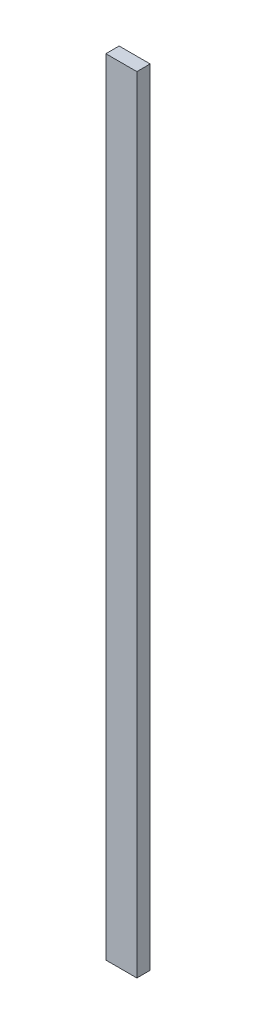
ISO-10303-21;
HEADER;
FILE_DESCRIPTION(('STEP AP214'),'2;1');
FILE_NAME('part.step','',(''),(''),'','','');
FILE_SCHEMA(('AUTOMOTIVE_DESIGN { 1 0 10303 214 1 1 1 1 }'));
ENDSEC;
DATA;
#1=APPLICATION_CONTEXT('core data for automotive mechanical design processes');
#2=APPLICATION_PROTOCOL_DEFINITION('international standard','automotive_design',2000,#1);
#3=PRODUCT_CONTEXT('',#1,'mechanical');
#4=PRODUCT('Part','Part','',(#3));
#5=PRODUCT_RELATED_PRODUCT_CATEGORY('part','',(#4));
#6=PRODUCT_DEFINITION_FORMATION('','',#4);
#7=PRODUCT_DEFINITION_CONTEXT('part definition',#1,'design');
#8=PRODUCT_DEFINITION('design','',#6,#7);
#9=PRODUCT_DEFINITION_SHAPE('','',#8);
#10=(LENGTH_UNIT() NAMED_UNIT(*) SI_UNIT(.MILLI.,.METRE.));
#11=(NAMED_UNIT(*) PLANE_ANGLE_UNIT() SI_UNIT($,.RADIAN.));
#12=(NAMED_UNIT(*) SI_UNIT($,.STERADIAN.) SOLID_ANGLE_UNIT());
#13=UNCERTAINTY_MEASURE_WITH_UNIT(LENGTH_MEASURE(1.E-05),#10,'distance_accuracy_value','');
#14=(GEOMETRIC_REPRESENTATION_CONTEXT(3) GLOBAL_UNCERTAINTY_ASSIGNED_CONTEXT((#13)) GLOBAL_UNIT_ASSIGNED_CONTEXT((#10,
#11,#12)) REPRESENTATION_CONTEXT('',''));
#15=CARTESIAN_POINT('',(0.,0.,0.));
#16=DIRECTION('',(0.,0.,1.));
#17=DIRECTION('',(1.,0.,0.));
#18=AXIS2_PLACEMENT_3D('',#15,#16,#17);
#19=CARTESIAN_POINT('',(-44.45,2247.9,19.05));
#20=DIRECTION('',(-1.,0.,0.));
#21=DIRECTION('',(0.,0.,1.));
#22=AXIS2_PLACEMENT_3D('',#19,#20,#21);
#23=PLANE('',#22);
#24=DIRECTION('',(0.,0.,-1.));
#25=VECTOR('',#24,1.);
#26=CARTESIAN_POINT('',(-44.45,0.,19.05));
#27=LINE('',#26,#25);
#28=CARTESIAN_POINT('',(-44.45,0.,19.05));
#29=VERTEX_POINT('',#28);
#30=CARTESIAN_POINT('',(-44.45,0.,-19.05));
#31=VERTEX_POINT('',#30);
#32=EDGE_CURVE('E104',#29,#31,#27,.T.);
#33=ORIENTED_EDGE('',*,*,#32,.F.);
#34=DIRECTION('',(0.,-1.,0.));
#35=VECTOR('',#34,1.);
#36=CARTESIAN_POINT('',(-44.45,2247.9,19.05));
#37=LINE('',#36,#35);
#38=CARTESIAN_POINT('',(-44.45,2247.9,19.05));
#39=VERTEX_POINT('',#38);
#40=EDGE_CURVE('E11',#39,#29,#37,.T.);
#41=ORIENTED_EDGE('',*,*,#40,.F.);
#42=DIRECTION('',(0.,0.,-1.));
#43=VECTOR('',#42,1.);
#44=CARTESIAN_POINT('',(-44.45,2247.9,19.05));
#45=LINE('',#44,#43);
#46=CARTESIAN_POINT('',(-44.45,2247.9,-19.05));
#47=VERTEX_POINT('',#46);
#48=EDGE_CURVE('E99',#39,#47,#45,.T.);
#49=ORIENTED_EDGE('',*,*,#48,.T.);
#50=DIRECTION('',(0.,-1.,0.));
#51=VECTOR('',#50,1.);
#52=CARTESIAN_POINT('',(-44.45,2247.9,-19.05));
#53=LINE('',#52,#51);
#54=EDGE_CURVE('E42',#47,#31,#53,.T.);
#55=ORIENTED_EDGE('',*,*,#54,.T.);
#56=EDGE_LOOP('',(#33,#41,#49,#55));
#57=FACE_BOUND('',#56,.T.);
#58=ADVANCED_FACE('F39',(#57),#23,.T.);
#59=CARTESIAN_POINT('',(-44.45,2247.9,19.05));
#60=DIRECTION('',(0.,0.,-1.));
#61=DIRECTION('',(-1.,0.,0.));
#62=AXIS2_PLACEMENT_3D('',#59,#60,#61);
#63=PLANE('',#62);
#64=DIRECTION('',(1.,0.,0.));
#65=VECTOR('',#64,1.);
#66=CARTESIAN_POINT('',(-44.45,0.,19.05));
#67=LINE('',#66,#65);
#68=CARTESIAN_POINT('',(44.45,0.,19.05));
#69=VERTEX_POINT('',#68);
#70=EDGE_CURVE('E72',#29,#69,#67,.T.);
#71=ORIENTED_EDGE('',*,*,#70,.T.);
#72=DIRECTION('',(0.,-1.,0.));
#73=VECTOR('',#72,1.);
#74=CARTESIAN_POINT('',(44.45,2247.9,19.05));
#75=LINE('',#74,#73);
#76=CARTESIAN_POINT('',(44.45,2247.9,19.05));
#77=VERTEX_POINT('',#76);
#78=EDGE_CURVE('E48',#77,#69,#75,.T.);
#79=ORIENTED_EDGE('',*,*,#78,.F.);
#80=DIRECTION('',(1.,0.,0.));
#81=VECTOR('',#80,1.);
#82=CARTESIAN_POINT('',(-44.45,2247.9,19.05));
#83=LINE('',#82,#81);
#84=EDGE_CURVE('E89',#39,#77,#83,.T.);
#85=ORIENTED_EDGE('',*,*,#84,.F.);
#86=ORIENTED_EDGE('',*,*,#40,.T.);
#87=EDGE_LOOP('',(#71,#79,#85,#86));
#88=FACE_BOUND('',#87,.T.);
#89=ADVANCED_FACE('F114',(#88),#63,.F.);
#90=CARTESIAN_POINT('',(44.45,2247.9,19.05));
#91=DIRECTION('',(-1.,0.,0.));
#92=DIRECTION('',(0.,0.,1.));
#93=AXIS2_PLACEMENT_3D('',#90,#91,#92);
#94=PLANE('',#93);
#95=DIRECTION('',(0.,0.,-1.));
#96=VECTOR('',#95,1.);
#97=CARTESIAN_POINT('',(44.45,0.,19.05));
#98=LINE('',#97,#96);
#99=CARTESIAN_POINT('',(44.45,0.,-19.05));
#100=VERTEX_POINT('',#99);
#101=EDGE_CURVE('E96',#69,#100,#98,.T.);
#102=ORIENTED_EDGE('',*,*,#101,.T.);
#103=DIRECTION('',(0.,-1.,0.));
#104=VECTOR('',#103,1.);
#105=CARTESIAN_POINT('',(44.45,2247.9,-19.05));
#106=LINE('',#105,#104);
#107=CARTESIAN_POINT('',(44.45,2247.9,-19.05));
#108=VERTEX_POINT('',#107);
#109=EDGE_CURVE('E93',#108,#100,#106,.T.);
#110=ORIENTED_EDGE('',*,*,#109,.F.);
#111=DIRECTION('',(0.,0.,-1.));
#112=VECTOR('',#111,1.);
#113=CARTESIAN_POINT('',(44.45,2247.9,19.05));
#114=LINE('',#113,#112);
#115=EDGE_CURVE('E84',#77,#108,#114,.T.);
#116=ORIENTED_EDGE('',*,*,#115,.F.);
#117=ORIENTED_EDGE('',*,*,#78,.T.);
#118=EDGE_LOOP('',(#102,#110,#116,#117));
#119=FACE_BOUND('',#118,.T.);
#120=ADVANCED_FACE('F94',(#119),#94,.F.);
#121=CARTESIAN_POINT('',(-44.45,2247.9,-19.05));
#122=DIRECTION('',(0.,0.,-1.));
#123=DIRECTION('',(-1.,0.,0.));
#124=AXIS2_PLACEMENT_3D('',#121,#122,#123);
#125=PLANE('',#124);
#126=DIRECTION('',(1.,0.,0.));
#127=VECTOR('',#126,1.);
#128=CARTESIAN_POINT('',(-44.45,0.,-19.05));
#129=LINE('',#128,#127);
#130=EDGE_CURVE('E107',#31,#100,#129,.T.);
#131=ORIENTED_EDGE('',*,*,#130,.F.);
#132=ORIENTED_EDGE('',*,*,#54,.F.);
#133=DIRECTION('',(1.,0.,0.));
#134=VECTOR('',#133,1.);
#135=CARTESIAN_POINT('',(-44.45,2247.9,-19.05));
#136=LINE('',#135,#134);
#137=EDGE_CURVE('E88',#47,#108,#136,.T.);
#138=ORIENTED_EDGE('',*,*,#137,.T.);
#139=ORIENTED_EDGE('',*,*,#109,.T.);
#140=EDGE_LOOP('',(#131,#132,#138,#139));
#141=FACE_BOUND('',#140,.T.);
#142=ADVANCED_FACE('F98',(#141),#125,.T.);
#143=CARTESIAN_POINT('',(0.,2247.9,0.));
#144=DIRECTION('',(0.,-1.,0.));
#145=DIRECTION('',(0.,0.,-1.));
#146=AXIS2_PLACEMENT_3D('',#143,#144,#145);
#147=PLANE('',#146);
#148=ORIENTED_EDGE('',*,*,#48,.F.);
#149=ORIENTED_EDGE('',*,*,#84,.T.);
#150=ORIENTED_EDGE('',*,*,#115,.T.);
#151=ORIENTED_EDGE('',*,*,#137,.F.);
#152=EDGE_LOOP('',(#148,#149,#150,#151));
#153=FACE_BOUND('',#152,.T.);
#154=ADVANCED_FACE('F87',(#153),#147,.F.);
#155=CARTESIAN_POINT('',(0.,0.,0.));
#156=DIRECTION('',(0.,-1.,0.));
#157=DIRECTION('',(0.,0.,-1.));
#158=AXIS2_PLACEMENT_3D('',#155,#156,#157);
#159=PLANE('',#158);
#160=ORIENTED_EDGE('',*,*,#32,.T.);
#161=ORIENTED_EDGE('',*,*,#130,.T.);
#162=ORIENTED_EDGE('',*,*,#101,.F.);
#163=ORIENTED_EDGE('',*,*,#70,.F.);
#164=EDGE_LOOP('',(#160,#161,#162,#163));
#165=FACE_BOUND('',#164,.T.);
#166=ADVANCED_FACE('F112',(#165),#159,.T.);
#167=CLOSED_SHELL('',(#58,#89,#120,#142,#154,#166));
#168=MANIFOLD_SOLID_BREP('B2',#167);
#169=ADVANCED_BREP_SHAPE_REPRESENTATION('',(#18,#168),#14);
#170=SHAPE_DEFINITION_REPRESENTATION(#9,#169);
ENDSEC;
END-ISO-10303-21;
